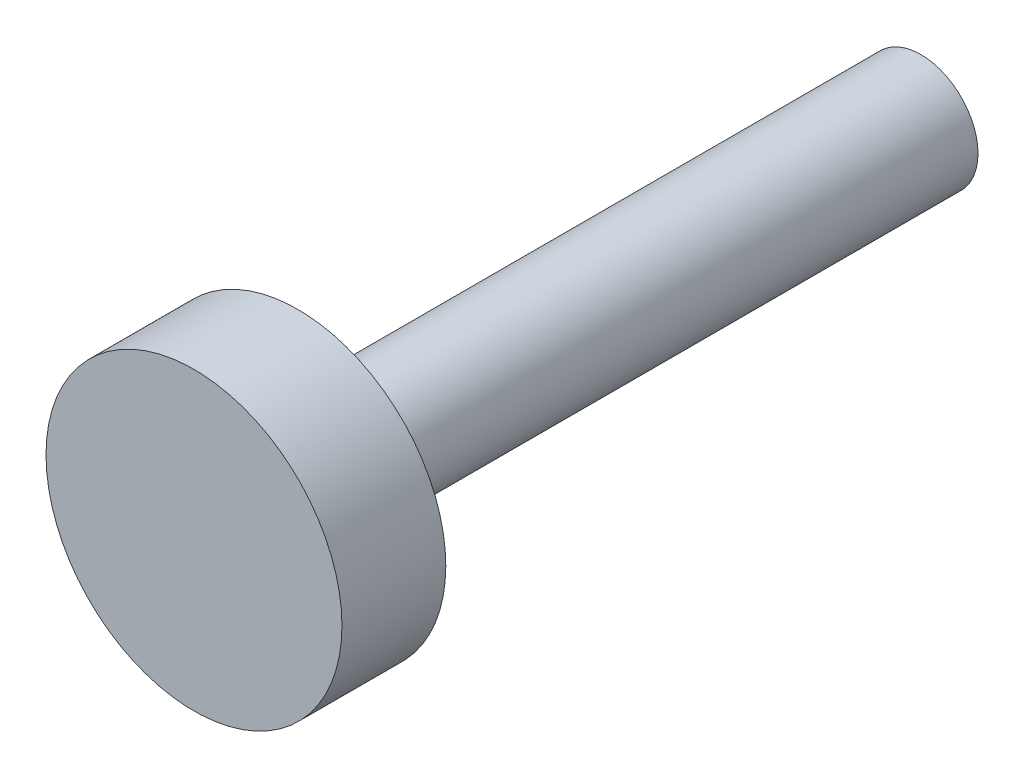
ISO-10303-21;
HEADER;
FILE_DESCRIPTION(('STEP AP214'),'2;1');
FILE_NAME('part.step','',(''),(''),'','','');
FILE_SCHEMA(('AUTOMOTIVE_DESIGN { 1 0 10303 214 1 1 1 1 }'));
ENDSEC;
DATA;
#1=APPLICATION_CONTEXT('core data for automotive mechanical design processes');
#2=APPLICATION_PROTOCOL_DEFINITION('international standard','automotive_design',2000,#1);
#3=PRODUCT_CONTEXT('',#1,'mechanical');
#4=PRODUCT('Part','Part','',(#3));
#5=PRODUCT_RELATED_PRODUCT_CATEGORY('part','',(#4));
#6=PRODUCT_DEFINITION_FORMATION('','',#4);
#7=PRODUCT_DEFINITION_CONTEXT('part definition',#1,'design');
#8=PRODUCT_DEFINITION('design','',#6,#7);
#9=PRODUCT_DEFINITION_SHAPE('','',#8);
#10=(LENGTH_UNIT() NAMED_UNIT(*) SI_UNIT(.MILLI.,.METRE.));
#11=(NAMED_UNIT(*) PLANE_ANGLE_UNIT() SI_UNIT($,.RADIAN.));
#12=(NAMED_UNIT(*) SI_UNIT($,.STERADIAN.) SOLID_ANGLE_UNIT());
#13=UNCERTAINTY_MEASURE_WITH_UNIT(LENGTH_MEASURE(1.E-05),#10,'distance_accuracy_value','');
#14=(GEOMETRIC_REPRESENTATION_CONTEXT(3) GLOBAL_UNCERTAINTY_ASSIGNED_CONTEXT((#13)) GLOBAL_UNIT_ASSIGNED_CONTEXT((#10,
#11,#12)) REPRESENTATION_CONTEXT('',''));
#15=CARTESIAN_POINT('',(0.,0.,0.));
#16=DIRECTION('',(0.,0.,1.));
#17=DIRECTION('',(1.,0.,0.));
#18=AXIS2_PLACEMENT_3D('',#15,#16,#17);
#19=CARTESIAN_POINT('',(0.,2.85,0.));
#20=DIRECTION('',(0.,0.,-1.));
#21=DIRECTION('',(-1.,0.,0.));
#22=AXIS2_PLACEMENT_3D('',#19,#20,#21);
#23=PLANE('',#22);
#24=CARTESIAN_POINT('',(0.,0.,0.));
#25=DIRECTION('',(0.,0.,1.));
#26=DIRECTION('',(1.,0.,0.));
#27=AXIS2_PLACEMENT_3D('',#24,#25,#26);
#28=CIRCLE('',#27,2.85);
#29=CARTESIAN_POINT('',(2.85,0.,0.));
#30=VERTEX_POINT('',#29);
#31=EDGE_CURVE('E45',#30,#30,#28,.T.);
#32=ORIENTED_EDGE('',*,*,#31,.T.);
#33=EDGE_LOOP('',(#32));
#34=FACE_BOUND('',#33,.T.);
#35=ADVANCED_FACE('F31',(#34),#23,.F.);
#36=CARTESIAN_POINT('',(0.,0.,-14.));
#37=DIRECTION('',(0.,0.,1.));
#38=DIRECTION('',(1.,0.,0.));
#39=AXIS2_PLACEMENT_3D('',#36,#37,#38);
#40=PLANE('',#39);
#41=CARTESIAN_POINT('',(0.,0.,-14.));
#42=DIRECTION('',(0.,0.,1.));
#43=DIRECTION('',(1.,0.,0.));
#44=AXIS2_PLACEMENT_3D('',#41,#42,#43);
#45=CIRCLE('',#44,1.1);
#46=CARTESIAN_POINT('',(1.1,0.,-14.));
#47=VERTEX_POINT('',#46);
#48=EDGE_CURVE('E10',#47,#47,#45,.T.);
#49=ORIENTED_EDGE('',*,*,#48,.F.);
#50=EDGE_LOOP('',(#49));
#51=FACE_BOUND('',#50,.T.);
#52=ADVANCED_FACE('F65',(#51),#40,.F.);
#53=CARTESIAN_POINT('',(0.,0.,0.));
#54=DIRECTION('',(0.,0.,1.));
#55=DIRECTION('',(1.,0.,0.));
#56=AXIS2_PLACEMENT_3D('',#53,#54,#55);
#57=CYLINDRICAL_SURFACE('',#56,1.1);
#58=CARTESIAN_POINT('',(0.,0.,-2.));
#59=DIRECTION('',(0.,0.,1.));
#60=DIRECTION('',(1.,0.,0.));
#61=AXIS2_PLACEMENT_3D('',#58,#59,#60);
#62=CIRCLE('',#61,1.1);
#63=CARTESIAN_POINT('',(1.1,0.,-2.));
#64=VERTEX_POINT('',#63);
#65=EDGE_CURVE('E37',#64,#64,#62,.T.);
#66=ORIENTED_EDGE('',*,*,#65,.F.);
#67=EDGE_LOOP('',(#66));
#68=FACE_BOUND('',#67,.T.);
#69=ORIENTED_EDGE('',*,*,#48,.T.);
#70=EDGE_LOOP('',(#69));
#71=FACE_BOUND('',#70,.T.);
#72=ADVANCED_FACE('F60',(#68,#71),#57,.T.);
#73=CARTESIAN_POINT('',(0.,1.1,-2.));
#74=DIRECTION('',(0.,0.,1.));
#75=DIRECTION('',(1.,0.,0.));
#76=AXIS2_PLACEMENT_3D('',#73,#74,#75);
#77=PLANE('',#76);
#78=CARTESIAN_POINT('',(0.,0.,-2.));
#79=DIRECTION('',(0.,0.,1.));
#80=DIRECTION('',(1.,0.,0.));
#81=AXIS2_PLACEMENT_3D('',#78,#79,#80);
#82=CIRCLE('',#81,2.85);
#83=CARTESIAN_POINT('',(2.85,0.,-2.));
#84=VERTEX_POINT('',#83);
#85=EDGE_CURVE('E41',#84,#84,#82,.T.);
#86=ORIENTED_EDGE('',*,*,#85,.F.);
#87=EDGE_LOOP('',(#86));
#88=FACE_BOUND('',#87,.T.);
#89=ORIENTED_EDGE('',*,*,#65,.T.);
#90=EDGE_LOOP('',(#89));
#91=FACE_BOUND('',#90,.T.);
#92=ADVANCED_FACE('F55',(#88,#91),#77,.F.);
#93=CARTESIAN_POINT('',(0.,0.,0.));
#94=DIRECTION('',(0.,0.,1.));
#95=DIRECTION('',(1.,0.,0.));
#96=AXIS2_PLACEMENT_3D('',#93,#94,#95);
#97=CYLINDRICAL_SURFACE('',#96,2.85);
#98=ORIENTED_EDGE('',*,*,#31,.F.);
#99=EDGE_LOOP('',(#98));
#100=FACE_BOUND('',#99,.T.);
#101=ORIENTED_EDGE('',*,*,#85,.T.);
#102=EDGE_LOOP('',(#101));
#103=FACE_BOUND('',#102,.T.);
#104=ADVANCED_FACE('F52',(#100,#103),#97,.T.);
#105=CLOSED_SHELL('',(#35,#52,#72,#92,#104));
#106=MANIFOLD_SOLID_BREP('B2',#105);
#107=ADVANCED_BREP_SHAPE_REPRESENTATION('',(#18,#106),#14);
#108=SHAPE_DEFINITION_REPRESENTATION(#9,#107);
ENDSEC;
END-ISO-10303-21;
